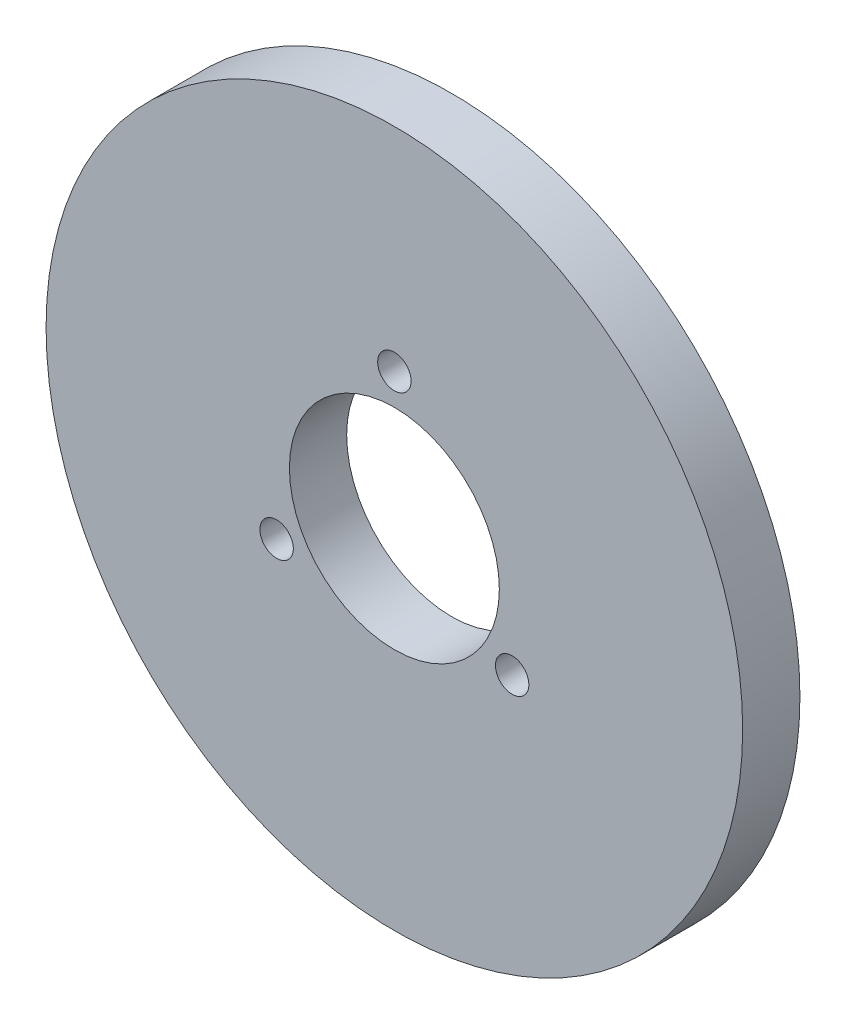
ISO-10303-21;
HEADER;
FILE_DESCRIPTION(('STEP AP214'),'2;1');
FILE_NAME('part.step','',(''),(''),'','','');
FILE_SCHEMA(('AUTOMOTIVE_DESIGN { 1 0 10303 214 1 1 1 1 }'));
ENDSEC;
DATA;
#1=APPLICATION_CONTEXT('core data for automotive mechanical design processes');
#2=APPLICATION_PROTOCOL_DEFINITION('international standard','automotive_design',2000,#1);
#3=PRODUCT_CONTEXT('',#1,'mechanical');
#4=PRODUCT('Part','Part','',(#3));
#5=PRODUCT_RELATED_PRODUCT_CATEGORY('part','',(#4));
#6=PRODUCT_DEFINITION_FORMATION('','',#4);
#7=PRODUCT_DEFINITION_CONTEXT('part definition',#1,'design');
#8=PRODUCT_DEFINITION('design','',#6,#7);
#9=PRODUCT_DEFINITION_SHAPE('','',#8);
#10=(LENGTH_UNIT() NAMED_UNIT(*) SI_UNIT(.MILLI.,.METRE.));
#11=(NAMED_UNIT(*) PLANE_ANGLE_UNIT() SI_UNIT($,.RADIAN.));
#12=(NAMED_UNIT(*) SI_UNIT($,.STERADIAN.) SOLID_ANGLE_UNIT());
#13=UNCERTAINTY_MEASURE_WITH_UNIT(LENGTH_MEASURE(1.E-05),#10,'distance_accuracy_value','');
#14=(GEOMETRIC_REPRESENTATION_CONTEXT(3) GLOBAL_UNCERTAINTY_ASSIGNED_CONTEXT((#13)) GLOBAL_UNIT_ASSIGNED_CONTEXT((#10,
#11,#12)) REPRESENTATION_CONTEXT('',''));
#15=CARTESIAN_POINT('',(0.,0.,0.));
#16=DIRECTION('',(0.,0.,1.));
#17=DIRECTION('',(1.,0.,0.));
#18=AXIS2_PLACEMENT_3D('',#15,#16,#17);
#19=CARTESIAN_POINT('',(200.,-1.04083408558608E-13,-0.4));
#20=DIRECTION('',(0.,0.,-1.));
#21=DIRECTION('',(0.,-1.,0.));
#22=AXIS2_PLACEMENT_3D('',#19,#20,#21);
#23=PLANE('',#22);
#24=CARTESIAN_POINT('',(226.629582456264,-8.65247584249866,-0.4));
#25=DIRECTION('',(0.,0.,-1.));
#26=DIRECTION('',(-1.,0.,0.));
#27=AXIS2_PLACEMENT_3D('',#24,#25,#26);
#28=CIRCLE('',#27,2.);
#29=CARTESIAN_POINT('',(224.629582456264,-8.65247584249866,-0.4));
#30=VERTEX_POINT('',#29);
#31=EDGE_CURVE('E11',#30,#30,#28,.T.);
#32=ORIENTED_EDGE('',*,*,#31,.T.);
#33=EDGE_LOOP('',(#32));
#34=FACE_BOUND('',#33,.T.);
#35=ADVANCED_FACE('F17',(#34),#23,.T.);
#36=CARTESIAN_POINT('',(226.629582456264,-8.65247584249866,-0.4));
#37=DIRECTION('',(0.,0.,-1.));
#38=DIRECTION('',(-1.,0.,0.));
#39=AXIS2_PLACEMENT_3D('',#36,#37,#38);
#40=CYLINDRICAL_SURFACE('',#39,2.);
#41=CARTESIAN_POINT('',(226.629582456264,-8.65247584249866,-6.));
#42=DIRECTION('',(0.,0.,-1.));
#43=DIRECTION('',(-1.,0.,0.));
#44=AXIS2_PLACEMENT_3D('',#41,#42,#43);
#45=CIRCLE('',#44,2.);
#46=CARTESIAN_POINT('',(224.629582456264,-8.65247584249866,-6.));
#47=VERTEX_POINT('',#46);
#48=EDGE_CURVE('E176',#47,#47,#45,.T.);
#49=ORIENTED_EDGE('',*,*,#48,.T.);
#50=EDGE_LOOP('',(#49));
#51=FACE_BOUND('',#50,.T.);
#52=ORIENTED_EDGE('',*,*,#31,.F.);
#53=EDGE_LOOP('',(#52));
#54=FACE_BOUND('',#53,.T.);
#55=ADVANCED_FACE('F230',(#51,#54),#40,.F.);
#56=CARTESIAN_POINT('',(200.,-1.04083408558608E-13,-0.4));
#57=DIRECTION('',(0.,0.,-1.));
#58=DIRECTION('',(0.,-1.,0.));
#59=AXIS2_PLACEMENT_3D('',#56,#57,#58);
#60=PLANE('',#59);
#61=CARTESIAN_POINT('',(173.370417543735,-8.65247584249865,-0.4));
#62=DIRECTION('',(0.,0.,-1.));
#63=DIRECTION('',(-1.,0.,0.));
#64=AXIS2_PLACEMENT_3D('',#61,#62,#63);
#65=CIRCLE('',#64,2.);
#66=CARTESIAN_POINT('',(171.370417543735,-8.65247584249865,-0.4));
#67=VERTEX_POINT('',#66);
#68=EDGE_CURVE('E28',#67,#67,#65,.T.);
#69=ORIENTED_EDGE('',*,*,#68,.T.);
#70=EDGE_LOOP('',(#69));
#71=FACE_BOUND('',#70,.T.);
#72=ADVANCED_FACE('F235',(#71),#60,.T.);
#73=CARTESIAN_POINT('',(173.370417543735,-8.65247584249865,-0.4));
#74=DIRECTION('',(0.,0.,-1.));
#75=DIRECTION('',(-1.,0.,0.));
#76=AXIS2_PLACEMENT_3D('',#73,#74,#75);
#77=CYLINDRICAL_SURFACE('',#76,2.);
#78=CARTESIAN_POINT('',(173.370417543735,-8.65247584249865,-6.));
#79=DIRECTION('',(0.,0.,-1.));
#80=DIRECTION('',(-1.,0.,0.));
#81=AXIS2_PLACEMENT_3D('',#78,#79,#80);
#82=CIRCLE('',#81,2.);
#83=CARTESIAN_POINT('',(171.370417543735,-8.65247584249865,-6.));
#84=VERTEX_POINT('',#83);
#85=EDGE_CURVE('E172',#84,#84,#82,.T.);
#86=ORIENTED_EDGE('',*,*,#85,.T.);
#87=EDGE_LOOP('',(#86));
#88=FACE_BOUND('',#87,.T.);
#89=ORIENTED_EDGE('',*,*,#68,.F.);
#90=EDGE_LOOP('',(#89));
#91=FACE_BOUND('',#90,.T.);
#92=ADVANCED_FACE('F255',(#88,#91),#77,.F.);
#93=CARTESIAN_POINT('',(200.,-1.04083408558608E-13,-0.4));
#94=DIRECTION('',(0.,0.,-1.));
#95=DIRECTION('',(0.,-1.,0.));
#96=AXIS2_PLACEMENT_3D('',#93,#94,#95);
#97=PLANE('',#96);
#98=CARTESIAN_POINT('',(183.542012935811,22.6524758424984,-0.4));
#99=DIRECTION('',(0.,0.,-1.));
#100=DIRECTION('',(-1.,0.,0.));
#101=AXIS2_PLACEMENT_3D('',#98,#99,#100);
#102=CIRCLE('',#101,2.);
#103=CARTESIAN_POINT('',(181.542012935811,22.6524758424984,-0.4));
#104=VERTEX_POINT('',#103);
#105=EDGE_CURVE('E182',#104,#104,#102,.T.);
#106=ORIENTED_EDGE('',*,*,#105,.T.);
#107=EDGE_LOOP('',(#106));
#108=FACE_BOUND('',#107,.T.);
#109=ADVANCED_FACE('F240',(#108),#97,.T.);
#110=CARTESIAN_POINT('',(183.542012935811,22.6524758424984,-0.4));
#111=DIRECTION('',(0.,0.,-1.));
#112=DIRECTION('',(-1.,0.,0.));
#113=AXIS2_PLACEMENT_3D('',#110,#111,#112);
#114=CYLINDRICAL_SURFACE('',#113,2.);
#115=CARTESIAN_POINT('',(183.542012935811,22.6524758424984,-6.));
#116=DIRECTION('',(0.,0.,-1.));
#117=DIRECTION('',(-1.,0.,0.));
#118=AXIS2_PLACEMENT_3D('',#115,#116,#117);
#119=CIRCLE('',#118,2.);
#120=CARTESIAN_POINT('',(181.542012935811,22.6524758424984,-6.));
#121=VERTEX_POINT('',#120);
#122=EDGE_CURVE('E175',#121,#121,#119,.T.);
#123=ORIENTED_EDGE('',*,*,#122,.T.);
#124=EDGE_LOOP('',(#123));
#125=FACE_BOUND('',#124,.T.);
#126=ORIENTED_EDGE('',*,*,#105,.F.);
#127=EDGE_LOOP('',(#126));
#128=FACE_BOUND('',#127,.T.);
#129=ADVANCED_FACE('F225',(#125,#128),#114,.F.);
#130=CARTESIAN_POINT('',(200.,-1.04083408558608E-13,-0.4));
#131=DIRECTION('',(0.,0.,-1.));
#132=DIRECTION('',(0.,-1.,0.));
#133=AXIS2_PLACEMENT_3D('',#130,#131,#132);
#134=PLANE('',#133);
#135=CARTESIAN_POINT('',(216.457987064189,22.6524758424984,-0.4));
#136=DIRECTION('',(0.,0.,-1.));
#137=DIRECTION('',(-1.,0.,0.));
#138=AXIS2_PLACEMENT_3D('',#135,#136,#137);
#139=CIRCLE('',#138,2.);
#140=CARTESIAN_POINT('',(214.457987064189,22.6524758424984,-0.4));
#141=VERTEX_POINT('',#140);
#142=EDGE_CURVE('E134',#141,#141,#139,.T.);
#143=ORIENTED_EDGE('',*,*,#142,.T.);
#144=EDGE_LOOP('',(#143));
#145=FACE_BOUND('',#144,.T.);
#146=ADVANCED_FACE('F209',(#145),#134,.T.);
#147=CARTESIAN_POINT('',(216.457987064189,22.6524758424984,-0.4));
#148=DIRECTION('',(0.,0.,-1.));
#149=DIRECTION('',(-1.,0.,0.));
#150=AXIS2_PLACEMENT_3D('',#147,#148,#149);
#151=CYLINDRICAL_SURFACE('',#150,2.);
#152=CARTESIAN_POINT('',(216.457987064189,22.6524758424984,-6.));
#153=DIRECTION('',(0.,0.,-1.));
#154=DIRECTION('',(-1.,0.,0.));
#155=AXIS2_PLACEMENT_3D('',#152,#153,#154);
#156=CIRCLE('',#155,2.);
#157=CARTESIAN_POINT('',(214.457987064189,22.6524758424984,-6.));
#158=VERTEX_POINT('',#157);
#159=EDGE_CURVE('E21',#158,#158,#156,.T.);
#160=ORIENTED_EDGE('',*,*,#159,.T.);
#161=EDGE_LOOP('',(#160));
#162=FACE_BOUND('',#161,.T.);
#163=ORIENTED_EDGE('',*,*,#142,.F.);
#164=EDGE_LOOP('',(#163));
#165=FACE_BOUND('',#164,.T.);
#166=ADVANCED_FACE('F213',(#162,#165),#151,.F.);
#167=CARTESIAN_POINT('',(200.,-1.04083408558608E-13,-0.4));
#168=DIRECTION('',(0.,0.,-1.));
#169=DIRECTION('',(0.,-1.,0.));
#170=AXIS2_PLACEMENT_3D('',#167,#168,#169);
#171=PLANE('',#170);
#172=CARTESIAN_POINT('',(200.,-28.,-0.4));
#173=DIRECTION('',(0.,0.,-1.));
#174=DIRECTION('',(-1.,0.,0.));
#175=AXIS2_PLACEMENT_3D('',#172,#173,#174);
#176=CIRCLE('',#175,2.);
#177=CARTESIAN_POINT('',(198.,-28.,-0.4));
#178=VERTEX_POINT('',#177);
#179=EDGE_CURVE('E127',#178,#178,#176,.T.);
#180=ORIENTED_EDGE('',*,*,#179,.T.);
#181=EDGE_LOOP('',(#180));
#182=FACE_BOUND('',#181,.T.);
#183=ADVANCED_FACE('F215',(#182),#171,.T.);
#184=CARTESIAN_POINT('',(200.,-28.,-0.4));
#185=DIRECTION('',(0.,0.,-1.));
#186=DIRECTION('',(-1.,0.,0.));
#187=AXIS2_PLACEMENT_3D('',#184,#185,#186);
#188=CYLINDRICAL_SURFACE('',#187,2.);
#189=CARTESIAN_POINT('',(200.,-28.,-6.));
#190=DIRECTION('',(0.,0.,-1.));
#191=DIRECTION('',(-1.,0.,0.));
#192=AXIS2_PLACEMENT_3D('',#189,#190,#191);
#193=CIRCLE('',#192,2.);
#194=CARTESIAN_POINT('',(198.,-28.,-6.));
#195=VERTEX_POINT('',#194);
#196=EDGE_CURVE('E148',#195,#195,#193,.T.);
#197=ORIENTED_EDGE('',*,*,#196,.T.);
#198=EDGE_LOOP('',(#197));
#199=FACE_BOUND('',#198,.T.);
#200=ORIENTED_EDGE('',*,*,#179,.F.);
#201=EDGE_LOOP('',(#200));
#202=FACE_BOUND('',#201,.T.);
#203=ADVANCED_FACE('F19',(#199,#202),#188,.F.);
#204=CARTESIAN_POINT('',(200.,-1.02154589849951E-13,-6.002));
#205=DIRECTION('',(0.,0.,1.));
#206=DIRECTION('',(1.,0.,0.));
#207=AXIS2_PLACEMENT_3D('',#204,#205,#206);
#208=CYLINDRICAL_SURFACE('',#207,11.);
#209=CARTESIAN_POINT('',(200.,-1.02154589849951E-13,0.));
#210=DIRECTION('',(0.,0.,-1.));
#211=DIRECTION('',(-1.,0.,0.));
#212=AXIS2_PLACEMENT_3D('',#209,#210,#211);
#213=CIRCLE('',#212,11.);
#214=CARTESIAN_POINT('',(189.,-1.02154589849951E-13,0.));
#215=VERTEX_POINT('',#214);
#216=EDGE_CURVE('E154',#215,#215,#213,.T.);
#217=ORIENTED_EDGE('',*,*,#216,.F.);
#218=EDGE_LOOP('',(#217));
#219=FACE_BOUND('',#218,.T.);
#220=CARTESIAN_POINT('',(200.,-1.02154589849951E-13,-6.));
#221=DIRECTION('',(0.,0.,1.));
#222=DIRECTION('',(-1.,0.,0.));
#223=AXIS2_PLACEMENT_3D('',#220,#221,#222);
#224=CIRCLE('',#223,11.);
#225=CARTESIAN_POINT('',(189.,-1.02154589849951E-13,-6.));
#226=VERTEX_POINT('',#225);
#227=EDGE_CURVE('E151',#226,#226,#224,.T.);
#228=ORIENTED_EDGE('',*,*,#227,.F.);
#229=EDGE_LOOP('',(#228));
#230=FACE_BOUND('',#229,.T.);
#231=ADVANCED_FACE('F272',(#219,#230),#208,.F.);
#232=CARTESIAN_POINT('',(200.,14.25,-3.));
#233=DIRECTION('',(0.,0.,-1.));
#234=DIRECTION('',(-1.,0.,0.));
#235=AXIS2_PLACEMENT_3D('',#232,#233,#234);
#236=CYLINDRICAL_SURFACE('',#235,3.);
#237=CARTESIAN_POINT('',(200.,14.25,-6.));
#238=DIRECTION('',(0.,0.,-1.));
#239=DIRECTION('',(-1.,0.,0.));
#240=AXIS2_PLACEMENT_3D('',#237,#238,#239);
#241=CIRCLE('',#240,3.);
#242=CARTESIAN_POINT('',(197.,14.25,-6.));
#243=VERTEX_POINT('',#242);
#244=EDGE_CURVE('E171',#243,#243,#241,.T.);
#245=ORIENTED_EDGE('',*,*,#244,.T.);
#246=EDGE_LOOP('',(#245));
#247=FACE_BOUND('',#246,.T.);
#248=CARTESIAN_POINT('',(200.,14.25,-3.));
#249=DIRECTION('',(0.,0.,-1.));
#250=DIRECTION('',(-1.,0.,0.));
#251=AXIS2_PLACEMENT_3D('',#248,#249,#250);
#252=CIRCLE('',#251,3.);
#253=CARTESIAN_POINT('',(197.,14.25,-3.));
#254=VERTEX_POINT('',#253);
#255=EDGE_CURVE('E123',#254,#254,#252,.T.);
#256=ORIENTED_EDGE('',*,*,#255,.F.);
#257=EDGE_LOOP('',(#256));
#258=FACE_BOUND('',#257,.T.);
#259=ADVANCED_FACE('F270',(#247,#258),#236,.F.);
#260=CARTESIAN_POINT('',(200.,-1.04083408558608E-13,-3.));
#261=DIRECTION('',(0.,0.,-1.));
#262=DIRECTION('',(0.,-1.,0.));
#263=AXIS2_PLACEMENT_3D('',#260,#261,#262);
#264=PLANE('',#263);
#265=CARTESIAN_POINT('',(200.,14.25,-3.));
#266=DIRECTION('',(0.,0.,1.));
#267=DIRECTION('',(-1.,0.,0.));
#268=AXIS2_PLACEMENT_3D('',#265,#266,#267);
#269=CIRCLE('',#268,1.75);
#270=CARTESIAN_POINT('',(198.25,14.25,-3.));
#271=VERTEX_POINT('',#270);
#272=EDGE_CURVE('E144',#271,#271,#269,.T.);
#273=ORIENTED_EDGE('',*,*,#272,.T.);
#274=EDGE_LOOP('',(#273));
#275=FACE_BOUND('',#274,.T.);
#276=ORIENTED_EDGE('',*,*,#255,.T.);
#277=EDGE_LOOP('',(#276));
#278=FACE_BOUND('',#277,.T.);
#279=ADVANCED_FACE('F124',(#275,#278),#264,.T.);
#280=CARTESIAN_POINT('',(212.340862003928,-7.12500000000009,-3.));
#281=DIRECTION('',(0.,0.,-1.));
#282=DIRECTION('',(-1.,0.,0.));
#283=AXIS2_PLACEMENT_3D('',#280,#281,#282);
#284=CYLINDRICAL_SURFACE('',#283,3.);
#285=CARTESIAN_POINT('',(212.340862003928,-7.12500000000009,-6.));
#286=DIRECTION('',(0.,0.,-1.));
#287=DIRECTION('',(-1.,0.,0.));
#288=AXIS2_PLACEMENT_3D('',#285,#286,#287);
#289=CIRCLE('',#288,3.);
#290=CARTESIAN_POINT('',(209.340862003928,-7.12500000000009,-6.));
#291=VERTEX_POINT('',#290);
#292=EDGE_CURVE('E161',#291,#291,#289,.T.);
#293=ORIENTED_EDGE('',*,*,#292,.T.);
#294=EDGE_LOOP('',(#293));
#295=FACE_BOUND('',#294,.T.);
#296=CARTESIAN_POINT('',(212.340862003928,-7.12500000000009,-3.));
#297=DIRECTION('',(0.,0.,-1.));
#298=DIRECTION('',(-1.,0.,0.));
#299=AXIS2_PLACEMENT_3D('',#296,#297,#298);
#300=CIRCLE('',#299,3.);
#301=CARTESIAN_POINT('',(209.340862003928,-7.12500000000009,-3.));
#302=VERTEX_POINT('',#301);
#303=EDGE_CURVE('E128',#302,#302,#300,.T.);
#304=ORIENTED_EDGE('',*,*,#303,.F.);
#305=EDGE_LOOP('',(#304));
#306=FACE_BOUND('',#305,.T.);
#307=ADVANCED_FACE('F248',(#295,#306),#284,.F.);
#308=CARTESIAN_POINT('',(200.,-1.04083408558608E-13,-3.));
#309=DIRECTION('',(0.,0.,-1.));
#310=DIRECTION('',(0.,-1.,0.));
#311=AXIS2_PLACEMENT_3D('',#308,#309,#310);
#312=PLANE('',#311);
#313=CARTESIAN_POINT('',(212.340862003928,-7.12500000000022,-3.));
#314=DIRECTION('',(0.,0.,1.));
#315=DIRECTION('',(-1.,0.,0.));
#316=AXIS2_PLACEMENT_3D('',#313,#314,#315);
#317=CIRCLE('',#316,1.7500000000001);
#318=CARTESIAN_POINT('',(210.590862003928,-7.12500000000022,-3.));
#319=VERTEX_POINT('',#318);
#320=EDGE_CURVE('E163',#319,#319,#317,.T.);
#321=ORIENTED_EDGE('',*,*,#320,.T.);
#322=EDGE_LOOP('',(#321));
#323=FACE_BOUND('',#322,.T.);
#324=ORIENTED_EDGE('',*,*,#303,.T.);
#325=EDGE_LOOP('',(#324));
#326=FACE_BOUND('',#325,.T.);
#327=ADVANCED_FACE('F251',(#323,#326),#312,.T.);
#328=CARTESIAN_POINT('',(187.659137996072,-7.125,-3.));
#329=DIRECTION('',(0.,0.,-1.));
#330=DIRECTION('',(-1.,0.,0.));
#331=AXIS2_PLACEMENT_3D('',#328,#329,#330);
#332=CYLINDRICAL_SURFACE('',#331,3.);
#333=CARTESIAN_POINT('',(187.659137996072,-7.125,-6.));
#334=DIRECTION('',(0.,0.,-1.));
#335=DIRECTION('',(-1.,0.,0.));
#336=AXIS2_PLACEMENT_3D('',#333,#334,#335);
#337=CIRCLE('',#336,3.);
#338=CARTESIAN_POINT('',(184.659137996072,-7.125,-6.));
#339=VERTEX_POINT('',#338);
#340=EDGE_CURVE('E179',#339,#339,#337,.T.);
#341=ORIENTED_EDGE('',*,*,#340,.T.);
#342=EDGE_LOOP('',(#341));
#343=FACE_BOUND('',#342,.T.);
#344=CARTESIAN_POINT('',(187.659137996072,-7.125,-3.));
#345=DIRECTION('',(0.,0.,-1.));
#346=DIRECTION('',(-1.,0.,0.));
#347=AXIS2_PLACEMENT_3D('',#344,#345,#346);
#348=CIRCLE('',#347,3.);
#349=CARTESIAN_POINT('',(184.659137996072,-7.125,-3.));
#350=VERTEX_POINT('',#349);
#351=EDGE_CURVE('E137',#350,#350,#348,.T.);
#352=ORIENTED_EDGE('',*,*,#351,.F.);
#353=EDGE_LOOP('',(#352));
#354=FACE_BOUND('',#353,.T.);
#355=ADVANCED_FACE('F260',(#343,#354),#332,.F.);
#356=CARTESIAN_POINT('',(200.,-1.04083408558608E-13,-3.));
#357=DIRECTION('',(0.,0.,-1.));
#358=DIRECTION('',(0.,-1.,0.));
#359=AXIS2_PLACEMENT_3D('',#356,#357,#358);
#360=PLANE('',#359);
#361=CARTESIAN_POINT('',(187.659137996072,-7.1250000000002,-3.));
#362=DIRECTION('',(0.,0.,1.));
#363=DIRECTION('',(-1.,0.,0.));
#364=AXIS2_PLACEMENT_3D('',#361,#362,#363);
#365=CIRCLE('',#364,1.7500000000001);
#366=CARTESIAN_POINT('',(185.909137996071,-7.1250000000002,-3.));
#367=VERTEX_POINT('',#366);
#368=EDGE_CURVE('E155',#367,#367,#365,.T.);
#369=ORIENTED_EDGE('',*,*,#368,.T.);
#370=EDGE_LOOP('',(#369));
#371=FACE_BOUND('',#370,.T.);
#372=ORIENTED_EDGE('',*,*,#351,.T.);
#373=EDGE_LOOP('',(#372));
#374=FACE_BOUND('',#373,.T.);
#375=ADVANCED_FACE('F257',(#371,#374),#360,.T.);
#376=CARTESIAN_POINT('',(200.,-1.04083408558608E-13,0.));
#377=DIRECTION('',(0.,0.,-1.));
#378=DIRECTION('',(0.,-1.,0.));
#379=AXIS2_PLACEMENT_3D('',#376,#377,#378);
#380=PLANE('',#379);
#381=CARTESIAN_POINT('',(200.,-1.05505237337688E-13,0.));
#382=DIRECTION('',(0.,0.,-1.));
#383=DIRECTION('',(-1.,0.,0.));
#384=AXIS2_PLACEMENT_3D('',#381,#382,#383);
#385=CIRCLE('',#384,36.5);
#386=CARTESIAN_POINT('',(163.5,-1.05505237337688E-13,0.));
#387=VERTEX_POINT('',#386);
#388=EDGE_CURVE('E186',#387,#387,#385,.T.);
#389=ORIENTED_EDGE('',*,*,#388,.F.);
#390=EDGE_LOOP('',(#389));
#391=FACE_BOUND('',#390,.T.);
#392=CARTESIAN_POINT('',(200.,14.25,0.));
#393=DIRECTION('',(0.,0.,-1.));
#394=DIRECTION('',(-1.,0.,0.));
#395=AXIS2_PLACEMENT_3D('',#392,#393,#394);
#396=CIRCLE('',#395,1.75);
#397=CARTESIAN_POINT('',(198.25,14.25,0.));
#398=VERTEX_POINT('',#397);
#399=EDGE_CURVE('E142',#398,#398,#396,.T.);
#400=ORIENTED_EDGE('',*,*,#399,.T.);
#401=EDGE_LOOP('',(#400));
#402=FACE_BOUND('',#401,.T.);
#403=CARTESIAN_POINT('',(212.340862003928,-7.12500000000022,0.));
#404=DIRECTION('',(0.,0.,-1.));
#405=DIRECTION('',(-1.,0.,0.));
#406=AXIS2_PLACEMENT_3D('',#403,#404,#405);
#407=CIRCLE('',#406,1.7500000000001);
#408=CARTESIAN_POINT('',(210.590862003928,-7.12500000000022,0.));
#409=VERTEX_POINT('',#408);
#410=EDGE_CURVE('E147',#409,#409,#407,.T.);
#411=ORIENTED_EDGE('',*,*,#410,.T.);
#412=EDGE_LOOP('',(#411));
#413=FACE_BOUND('',#412,.T.);
#414=CARTESIAN_POINT('',(187.659137996072,-7.1250000000002,0.));
#415=DIRECTION('',(0.,0.,-1.));
#416=DIRECTION('',(-1.,0.,0.));
#417=AXIS2_PLACEMENT_3D('',#414,#415,#416);
#418=CIRCLE('',#417,1.7500000000001);
#419=CARTESIAN_POINT('',(185.909137996071,-7.1250000000002,0.));
#420=VERTEX_POINT('',#419);
#421=EDGE_CURVE('E159',#420,#420,#418,.T.);
#422=ORIENTED_EDGE('',*,*,#421,.T.);
#423=EDGE_LOOP('',(#422));
#424=FACE_BOUND('',#423,.T.);
#425=ORIENTED_EDGE('',*,*,#216,.T.);
#426=EDGE_LOOP('',(#425));
#427=FACE_BOUND('',#426,.T.);
#428=ADVANCED_FACE('F259',(#391,#402,#413,#424,#427),#380,.F.);
#429=CARTESIAN_POINT('',(200.,-1.04083408558608E-13,-6.));
#430=DIRECTION('',(0.,0.,-1.));
#431=DIRECTION('',(0.,-1.,0.));
#432=AXIS2_PLACEMENT_3D('',#429,#430,#431);
#433=PLANE('',#432);
#434=CARTESIAN_POINT('',(200.,-1.05505237337688E-13,-6.));
#435=DIRECTION('',(0.,0.,-1.));
#436=DIRECTION('',(-1.,0.,0.));
#437=AXIS2_PLACEMENT_3D('',#434,#435,#436);
#438=CIRCLE('',#437,36.5);
#439=CARTESIAN_POINT('',(163.5,-1.05505237337688E-13,-6.));
#440=VERTEX_POINT('',#439);
#441=EDGE_CURVE('E158',#440,#440,#438,.T.);
#442=ORIENTED_EDGE('',*,*,#441,.T.);
#443=EDGE_LOOP('',(#442));
#444=FACE_BOUND('',#443,.T.);
#445=ORIENTED_EDGE('',*,*,#292,.F.);
#446=EDGE_LOOP('',(#445));
#447=FACE_BOUND('',#446,.T.);
#448=ORIENTED_EDGE('',*,*,#244,.F.);
#449=EDGE_LOOP('',(#448));
#450=FACE_BOUND('',#449,.T.);
#451=ORIENTED_EDGE('',*,*,#340,.F.);
#452=EDGE_LOOP('',(#451));
#453=FACE_BOUND('',#452,.T.);
#454=ORIENTED_EDGE('',*,*,#227,.T.);
#455=EDGE_LOOP('',(#454));
#456=FACE_BOUND('',#455,.T.);
#457=ORIENTED_EDGE('',*,*,#196,.F.);
#458=EDGE_LOOP('',(#457));
#459=FACE_BOUND('',#458,.T.);
#460=ORIENTED_EDGE('',*,*,#159,.F.);
#461=EDGE_LOOP('',(#460));
#462=FACE_BOUND('',#461,.T.);
#463=ORIENTED_EDGE('',*,*,#122,.F.);
#464=EDGE_LOOP('',(#463));
#465=FACE_BOUND('',#464,.T.);
#466=ORIENTED_EDGE('',*,*,#85,.F.);
#467=EDGE_LOOP('',(#466));
#468=FACE_BOUND('',#467,.T.);
#469=ORIENTED_EDGE('',*,*,#48,.F.);
#470=EDGE_LOOP('',(#469));
#471=FACE_BOUND('',#470,.T.);
#472=ADVANCED_FACE('F246',(#444,#447,#450,#453,#456,#459,#462,#465,#468,#471),#433,.T.);
#473=CARTESIAN_POINT('',(200.,-1.05505237337688E-13,-6.));
#474=DIRECTION('',(0.,0.,1.));
#475=DIRECTION('',(1.,0.,0.));
#476=AXIS2_PLACEMENT_3D('',#473,#474,#475);
#477=CYLINDRICAL_SURFACE('',#476,36.5);
#478=ORIENTED_EDGE('',*,*,#388,.T.);
#479=EDGE_LOOP('',(#478));
#480=FACE_BOUND('',#479,.T.);
#481=ORIENTED_EDGE('',*,*,#441,.F.);
#482=EDGE_LOOP('',(#481));
#483=FACE_BOUND('',#482,.T.);
#484=ADVANCED_FACE('F242',(#480,#483),#477,.T.);
#485=CARTESIAN_POINT('',(187.659137996072,-7.1250000000002,0.));
#486=DIRECTION('',(0.,0.,-1.));
#487=DIRECTION('',(-1.,0.,0.));
#488=AXIS2_PLACEMENT_3D('',#485,#486,#487);
#489=CYLINDRICAL_SURFACE('',#488,1.7500000000001);
#490=ORIENTED_EDGE('',*,*,#368,.F.);
#491=EDGE_LOOP('',(#490));
#492=FACE_BOUND('',#491,.T.);
#493=ORIENTED_EDGE('',*,*,#421,.F.);
#494=EDGE_LOOP('',(#493));
#495=FACE_BOUND('',#494,.T.);
#496=ADVANCED_FACE('F245',(#492,#495),#489,.F.);
#497=CARTESIAN_POINT('',(212.340862003928,-7.12500000000022,0.));
#498=DIRECTION('',(0.,0.,-1.));
#499=DIRECTION('',(-1.,0.,0.));
#500=AXIS2_PLACEMENT_3D('',#497,#498,#499);
#501=CYLINDRICAL_SURFACE('',#500,1.7500000000001);
#502=ORIENTED_EDGE('',*,*,#320,.F.);
#503=EDGE_LOOP('',(#502));
#504=FACE_BOUND('',#503,.T.);
#505=ORIENTED_EDGE('',*,*,#410,.F.);
#506=EDGE_LOOP('',(#505));
#507=FACE_BOUND('',#506,.T.);
#508=ADVANCED_FACE('F268',(#504,#507),#501,.F.);
#509=CARTESIAN_POINT('',(200.,14.25,0.));
#510=DIRECTION('',(0.,0.,-1.));
#511=DIRECTION('',(-1.,0.,0.));
#512=AXIS2_PLACEMENT_3D('',#509,#510,#511);
#513=CYLINDRICAL_SURFACE('',#512,1.75);
#514=ORIENTED_EDGE('',*,*,#272,.F.);
#515=EDGE_LOOP('',(#514));
#516=FACE_BOUND('',#515,.T.);
#517=ORIENTED_EDGE('',*,*,#399,.F.);
#518=EDGE_LOOP('',(#517));
#519=FACE_BOUND('',#518,.T.);
#520=ADVANCED_FACE('F266',(#516,#519),#513,.F.);
#521=CLOSED_SHELL('',(#35,#55,#72,#92,#109,#129,#146,#166,#183,#203,#231,#259,#279,#307,#327,
#355,#375,#428,#472,#484,#496,#508,#520));
#522=MANIFOLD_SOLID_BREP('B1',#521);
#523=ADVANCED_BREP_SHAPE_REPRESENTATION('',(#18,#522),#14);
#524=SHAPE_DEFINITION_REPRESENTATION(#9,#523);
ENDSEC;
END-ISO-10303-21;
